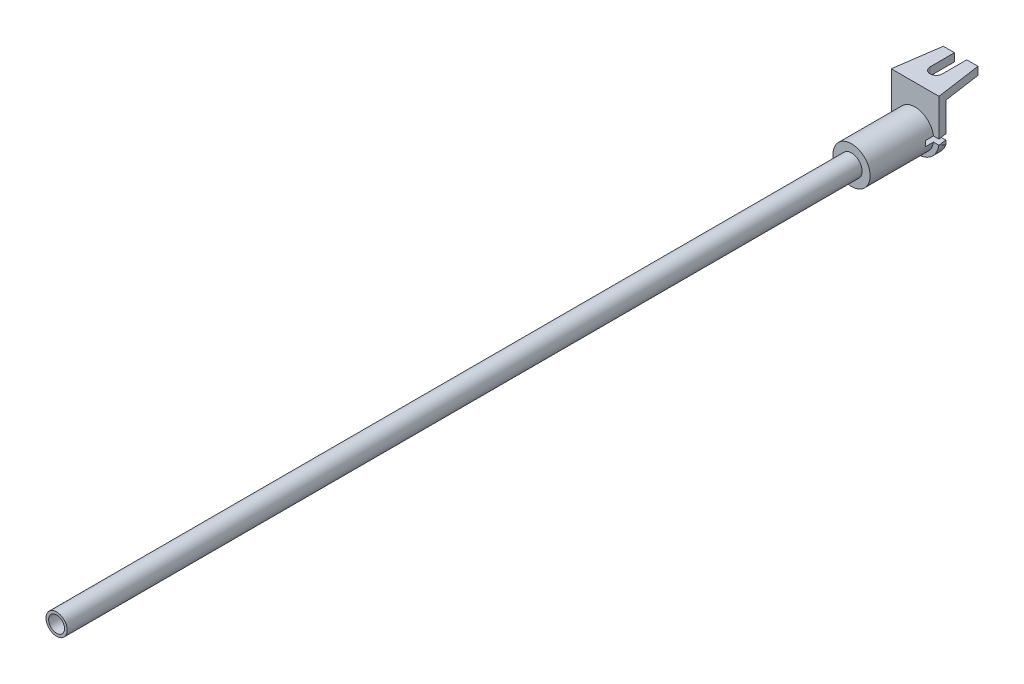
ISO-10303-21;
HEADER;
FILE_DESCRIPTION(('STEP AP214'),'2;1');
FILE_NAME('part.step','',(''),(''),'','','');
FILE_SCHEMA(('AUTOMOTIVE_DESIGN { 1 0 10303 214 1 1 1 1 }'));
ENDSEC;
DATA;
#1=APPLICATION_CONTEXT('core data for automotive mechanical design processes');
#2=APPLICATION_PROTOCOL_DEFINITION('international standard','automotive_design',2000,#1);
#3=PRODUCT_CONTEXT('',#1,'mechanical');
#4=PRODUCT('Part','Part','',(#3));
#5=PRODUCT_RELATED_PRODUCT_CATEGORY('part','',(#4));
#6=PRODUCT_DEFINITION_FORMATION('','',#4);
#7=PRODUCT_DEFINITION_CONTEXT('part definition',#1,'design');
#8=PRODUCT_DEFINITION('design','',#6,#7);
#9=PRODUCT_DEFINITION_SHAPE('','',#8);
#10=(LENGTH_UNIT() NAMED_UNIT(*) SI_UNIT(.MILLI.,.METRE.));
#11=(NAMED_UNIT(*) PLANE_ANGLE_UNIT() SI_UNIT($,.RADIAN.));
#12=(NAMED_UNIT(*) SI_UNIT($,.STERADIAN.) SOLID_ANGLE_UNIT());
#13=UNCERTAINTY_MEASURE_WITH_UNIT(LENGTH_MEASURE(1.E-05),#10,'distance_accuracy_value','');
#14=(GEOMETRIC_REPRESENTATION_CONTEXT(3) GLOBAL_UNCERTAINTY_ASSIGNED_CONTEXT((#13)) GLOBAL_UNIT_ASSIGNED_CONTEXT((#10,
#11,#12)) REPRESENTATION_CONTEXT('',''));
#15=CARTESIAN_POINT('',(0.,0.,0.));
#16=DIRECTION('',(0.,0.,1.));
#17=DIRECTION('',(1.,0.,0.));
#18=AXIS2_PLACEMENT_3D('',#15,#16,#17);
#19=CARTESIAN_POINT('',(0.,0.,12.));
#20=DIRECTION('',(0.,0.,1.));
#21=DIRECTION('',(1.,0.,0.));
#22=AXIS2_PLACEMENT_3D('',#19,#20,#21);
#23=PLANE('',#22);
#24=CARTESIAN_POINT('',(0.,0.,12.));
#25=DIRECTION('',(0.,0.,1.));
#26=DIRECTION('',(1.,0.,0.));
#27=AXIS2_PLACEMENT_3D('',#24,#25,#26);
#28=CIRCLE('',#27,3.5);
#29=CARTESIAN_POINT('',(3.5,0.,12.));
#30=VERTEX_POINT('',#29);
#31=EDGE_CURVE('E323',#30,#30,#28,.T.);
#32=ORIENTED_EDGE('',*,*,#31,.T.);
#33=EDGE_LOOP('',(#32));
#34=FACE_BOUND('',#33,.T.);
#35=CARTESIAN_POINT('',(0.,0.,12.));
#36=DIRECTION('',(0.,0.,1.));
#37=DIRECTION('',(1.,0.,0.));
#38=AXIS2_PLACEMENT_3D('',#35,#36,#37);
#39=CIRCLE('',#38,2.);
#40=CARTESIAN_POINT('',(2.,0.,12.));
#41=VERTEX_POINT('',#40);
#42=EDGE_CURVE('E311',#41,#41,#39,.T.);
#43=ORIENTED_EDGE('',*,*,#42,.F.);
#44=EDGE_LOOP('',(#43));
#45=FACE_BOUND('',#44,.T.);
#46=ADVANCED_FACE('F31',(#34,#45),#23,.T.);
#47=CARTESIAN_POINT('',(0.,0.,12.));
#48=DIRECTION('',(0.,0.,1.));
#49=DIRECTION('',(1.,0.,0.));
#50=AXIS2_PLACEMENT_3D('',#47,#48,#49);
#51=CIRCLE('',#50,1.5);
#52=CARTESIAN_POINT('',(1.5,0.,12.));
#53=VERTEX_POINT('',#52);
#54=EDGE_CURVE('E326',#53,#53,#51,.F.);
#55=ORIENTED_EDGE('',*,*,#54,.F.);
#56=EDGE_LOOP('',(#55));
#57=FACE_BOUND('',#56,.T.);
#58=CARTESIAN_POINT('',(0.,0.,12.));
#59=DIRECTION('',(0.,0.,1.));
#60=DIRECTION('',(1.,0.,0.));
#61=AXIS2_PLACEMENT_3D('',#58,#59,#60);
#62=CIRCLE('',#61,1.);
#63=CARTESIAN_POINT('',(1.,0.,12.));
#64=VERTEX_POINT('',#63);
#65=EDGE_CURVE('E320',#64,#64,#62,.T.);
#66=ORIENTED_EDGE('',*,*,#65,.F.);
#67=EDGE_LOOP('',(#66));
#68=FACE_BOUND('',#67,.T.);
#69=ADVANCED_FACE('F402',(#57,#68),#23,.T.);
#70=CARTESIAN_POINT('',(0.,0.,12.));
#71=DIRECTION('',(0.,0.,-1.));
#72=DIRECTION('',(-1.,0.,0.));
#73=AXIS2_PLACEMENT_3D('',#70,#71,#72);
#74=CYLINDRICAL_SURFACE('',#73,3.5);
#75=CARTESIAN_POINT('',(0.,0.,0.));
#76=DIRECTION('',(0.,0.,-1.));
#77=DIRECTION('',(-1.,0.,0.));
#78=AXIS2_PLACEMENT_3D('',#75,#76,#77);
#79=CIRCLE('',#78,3.5);
#80=CARTESIAN_POINT('',(3.46410161513775,-0.5,0.));
#81=VERTEX_POINT('',#80);
#82=CARTESIAN_POINT('',(3.46410161513775,0.5,0.));
#83=VERTEX_POINT('',#82);
#84=EDGE_CURVE('E305',#81,#83,#79,.T.);
#85=ORIENTED_EDGE('',*,*,#84,.F.);
#86=DIRECTION('',(0.,0.,-1.));
#87=VECTOR('',#86,1.);
#88=CARTESIAN_POINT('',(3.46410161513775,-0.500000000000002,12.));
#89=LINE('',#88,#87);
#90=CARTESIAN_POINT('',(3.46410161513775,-0.500000000000001,1.5));
#91=VERTEX_POINT('',#90);
#92=EDGE_CURVE('E265',#81,#91,#89,.F.);
#93=ORIENTED_EDGE('',*,*,#92,.T.);
#94=CARTESIAN_POINT('',(0.,0.,1.5));
#95=DIRECTION('',(0.,0.,1.));
#96=DIRECTION('',(1.,0.,0.));
#97=AXIS2_PLACEMENT_3D('',#94,#95,#96);
#98=CIRCLE('',#97,3.5);
#99=CARTESIAN_POINT('',(3.46410161513775,0.499999999999999,1.5));
#100=VERTEX_POINT('',#99);
#101=EDGE_CURVE('E285',#91,#100,#98,.T.);
#102=ORIENTED_EDGE('',*,*,#101,.T.);
#103=DIRECTION('',(0.,0.,-1.));
#104=VECTOR('',#103,1.);
#105=CARTESIAN_POINT('',(3.46410161513775,0.499999999999998,12.));
#106=LINE('',#105,#104);
#107=EDGE_CURVE('E276',#100,#83,#106,.T.);
#108=ORIENTED_EDGE('',*,*,#107,.T.);
#109=EDGE_LOOP('',(#85,#93,#102,#108));
#110=FACE_BOUND('',#109,.T.);
#111=ORIENTED_EDGE('',*,*,#31,.F.);
#112=EDGE_LOOP('',(#111));
#113=FACE_BOUND('',#112,.T.);
#114=ADVANCED_FACE('F33',(#110,#113),#74,.T.);
#115=CARTESIAN_POINT('',(0.,0.,12.));
#116=DIRECTION('',(0.,0.,-1.));
#117=DIRECTION('',(-1.,0.,0.));
#118=AXIS2_PLACEMENT_3D('',#115,#116,#117);
#119=CYLINDRICAL_SURFACE('',#118,1.);
#120=DIRECTION('',(0.,0.,-1.));
#121=VECTOR('',#120,1.);
#122=CARTESIAN_POINT('',(0.866025403784437,-0.500000000000002,12.));
#123=LINE('',#122,#121);
#124=CARTESIAN_POINT('',(0.866025403784439,-0.5,0.));
#125=VERTEX_POINT('',#124);
#126=CARTESIAN_POINT('',(0.866025403784438,-0.5,1.5));
#127=VERTEX_POINT('',#126);
#128=EDGE_CURVE('E271',#125,#127,#123,.F.);
#129=ORIENTED_EDGE('',*,*,#128,.F.);
#130=CARTESIAN_POINT('',(0.,0.,0.));
#131=DIRECTION('',(0.,0.,1.));
#132=DIRECTION('',(1.,0.,0.));
#133=AXIS2_PLACEMENT_3D('',#130,#131,#132);
#134=CIRCLE('',#133,1.);
#135=CARTESIAN_POINT('',(0.866025403784439,0.5,0.));
#136=VERTEX_POINT('',#135);
#137=EDGE_CURVE('E317',#136,#125,#134,.T.);
#138=ORIENTED_EDGE('',*,*,#137,.F.);
#139=DIRECTION('',(0.,0.,-1.));
#140=VECTOR('',#139,1.);
#141=CARTESIAN_POINT('',(0.86602540378444,0.499999999999998,12.));
#142=LINE('',#141,#140);
#143=CARTESIAN_POINT('',(0.866025403784439,0.5,1.5));
#144=VERTEX_POINT('',#143);
#145=EDGE_CURVE('E54',#144,#136,#142,.T.);
#146=ORIENTED_EDGE('',*,*,#145,.F.);
#147=CARTESIAN_POINT('',(0.,0.,1.5));
#148=DIRECTION('',(0.,0.,1.));
#149=DIRECTION('',(1.,0.,0.));
#150=AXIS2_PLACEMENT_3D('',#147,#148,#149);
#151=CIRCLE('',#150,1.);
#152=EDGE_CURVE('E347',#127,#144,#151,.T.);
#153=ORIENTED_EDGE('',*,*,#152,.F.);
#154=EDGE_LOOP('',(#129,#138,#146,#153));
#155=FACE_BOUND('',#154,.T.);
#156=ORIENTED_EDGE('',*,*,#65,.T.);
#157=EDGE_LOOP('',(#156));
#158=FACE_BOUND('',#157,.T.);
#159=ADVANCED_FACE('F368',(#155,#158),#119,.F.);
#160=CARTESIAN_POINT('',(0.,0.,162.));
#161=DIRECTION('',(0.,0.,1.));
#162=DIRECTION('',(1.,0.,0.));
#163=AXIS2_PLACEMENT_3D('',#160,#161,#162);
#164=PLANE('',#163);
#165=CARTESIAN_POINT('',(0.,0.,162.));
#166=DIRECTION('',(0.,0.,1.));
#167=DIRECTION('',(1.,0.,0.));
#168=AXIS2_PLACEMENT_3D('',#165,#166,#167);
#169=CIRCLE('',#168,2.);
#170=CARTESIAN_POINT('',(2.,0.,162.));
#171=VERTEX_POINT('',#170);
#172=EDGE_CURVE('E314',#171,#171,#169,.T.);
#173=ORIENTED_EDGE('',*,*,#172,.T.);
#174=EDGE_LOOP('',(#173));
#175=FACE_BOUND('',#174,.T.);
#176=CARTESIAN_POINT('',(0.,0.,162.));
#177=DIRECTION('',(0.,0.,1.));
#178=DIRECTION('',(1.,0.,0.));
#179=AXIS2_PLACEMENT_3D('',#176,#177,#178);
#180=CIRCLE('',#179,1.5);
#181=CARTESIAN_POINT('',(1.5,0.,162.));
#182=VERTEX_POINT('',#181);
#183=EDGE_CURVE('E308',#182,#182,#180,.T.);
#184=ORIENTED_EDGE('',*,*,#183,.F.);
#185=EDGE_LOOP('',(#184));
#186=FACE_BOUND('',#185,.T.);
#187=ADVANCED_FACE('F412',(#175,#186),#164,.T.);
#188=CARTESIAN_POINT('',(0.,0.,162.));
#189=DIRECTION('',(0.,0.,-1.));
#190=DIRECTION('',(-1.,0.,0.));
#191=AXIS2_PLACEMENT_3D('',#188,#189,#190);
#192=CYLINDRICAL_SURFACE('',#191,2.);
#193=ORIENTED_EDGE('',*,*,#172,.F.);
#194=EDGE_LOOP('',(#193));
#195=FACE_BOUND('',#194,.T.);
#196=ORIENTED_EDGE('',*,*,#42,.T.);
#197=EDGE_LOOP('',(#196));
#198=FACE_BOUND('',#197,.T.);
#199=ADVANCED_FACE('F413',(#195,#198),#192,.T.);
#200=CARTESIAN_POINT('',(0.,0.,162.));
#201=DIRECTION('',(0.,0.,-1.));
#202=DIRECTION('',(-1.,0.,0.));
#203=AXIS2_PLACEMENT_3D('',#200,#201,#202);
#204=CYLINDRICAL_SURFACE('',#203,1.5);
#205=ORIENTED_EDGE('',*,*,#183,.T.);
#206=EDGE_LOOP('',(#205));
#207=FACE_BOUND('',#206,.T.);
#208=ORIENTED_EDGE('',*,*,#54,.T.);
#209=EDGE_LOOP('',(#208));
#210=FACE_BOUND('',#209,.T.);
#211=ADVANCED_FACE('F416',(#207,#210),#204,.F.);
#212=CARTESIAN_POINT('',(4.5,0.,0.));
#213=DIRECTION('',(0.,0.,-1.));
#214=DIRECTION('',(-1.,0.,0.));
#215=AXIS2_PLACEMENT_3D('',#212,#213,#214);
#216=PLANE('',#215);
#217=ORIENTED_EDGE('',*,*,#137,.T.);
#218=DIRECTION('',(-1.,0.,0.));
#219=VECTOR('',#218,1.);
#220=CARTESIAN_POINT('',(4.5,-0.500000000000001,0.));
#221=LINE('',#220,#219);
#222=CARTESIAN_POINT('',(0.,-0.5,0.));
#223=VERTEX_POINT('',#222);
#224=EDGE_CURVE('E268',#125,#223,#221,.T.);
#225=ORIENTED_EDGE('',*,*,#224,.T.);
#226=DIRECTION('',(0.,1.,0.));
#227=VECTOR('',#226,1.);
#228=CARTESIAN_POINT('',(0.,0.,0.));
#229=LINE('',#228,#227);
#230=CARTESIAN_POINT('',(0.,0.5,0.));
#231=VERTEX_POINT('',#230);
#232=EDGE_CURVE('E282',#223,#231,#229,.T.);
#233=ORIENTED_EDGE('',*,*,#232,.T.);
#234=DIRECTION('',(1.,0.,0.));
#235=VECTOR('',#234,1.);
#236=CARTESIAN_POINT('',(4.5,0.499999999999999,0.));
#237=LINE('',#236,#235);
#238=EDGE_CURVE('E279',#231,#136,#237,.T.);
#239=ORIENTED_EDGE('',*,*,#238,.T.);
#240=EDGE_LOOP('',(#217,#225,#233,#239));
#241=FACE_BOUND('',#240,.T.);
#242=ADVANCED_FACE('F365',(#241),#216,.F.);
#243=CARTESIAN_POINT('',(0.5,0.,0.));
#244=DIRECTION('',(0.,0.,-1.));
#245=DIRECTION('',(-1.,0.,0.));
#246=AXIS2_PLACEMENT_3D('',#243,#244,#245);
#247=CIRCLE('',#246,4.);
#248=CARTESIAN_POINT('',(0.5,-4.,0.));
#249=VERTEX_POINT('',#248);
#250=CARTESIAN_POINT('',(4.46862696659689,-0.500000000000001,0.));
#251=VERTEX_POINT('',#250);
#252=EDGE_CURVE('E339',#249,#251,#247,.F.);
#253=ORIENTED_EDGE('',*,*,#252,.T.);
#254=DIRECTION('',(-1.,0.,0.));
#255=VECTOR('',#254,1.);
#256=CARTESIAN_POINT('',(4.5,-0.500000000000001,0.));
#257=LINE('',#256,#255);
#258=EDGE_CURVE('E261',#251,#81,#257,.T.);
#259=ORIENTED_EDGE('',*,*,#258,.T.);
#260=ORIENTED_EDGE('',*,*,#84,.T.);
#261=DIRECTION('',(1.,0.,0.));
#262=VECTOR('',#261,1.);
#263=CARTESIAN_POINT('',(4.5,0.499999999999999,0.));
#264=LINE('',#263,#262);
#265=CARTESIAN_POINT('',(4.5,0.499999999999999,0.));
#266=VERTEX_POINT('',#265);
#267=EDGE_CURVE('E273',#83,#266,#264,.T.);
#268=ORIENTED_EDGE('',*,*,#267,.T.);
#269=DIRECTION('',(0.,-1.,0.));
#270=VECTOR('',#269,1.);
#271=CARTESIAN_POINT('',(4.5,-4.,0.));
#272=LINE('',#271,#270);
#273=CARTESIAN_POINT('',(4.5,7.5,0.));
#274=VERTEX_POINT('',#273);
#275=EDGE_CURVE('E291',#274,#266,#272,.T.);
#276=ORIENTED_EDGE('',*,*,#275,.F.);
#277=DIRECTION('',(-1.,0.,0.));
#278=VECTOR('',#277,1.);
#279=CARTESIAN_POINT('',(4.5,7.5,0.));
#280=LINE('',#279,#278);
#281=CARTESIAN_POINT('',(-4.5,7.5,0.));
#282=VERTEX_POINT('',#281);
#283=EDGE_CURVE('E293',#274,#282,#280,.T.);
#284=ORIENTED_EDGE('',*,*,#283,.T.);
#285=DIRECTION('',(0.,-1.,0.));
#286=VECTOR('',#285,1.);
#287=CARTESIAN_POINT('',(-4.5,0.,0.));
#288=LINE('',#287,#286);
#289=CARTESIAN_POINT('',(-4.5,0.,0.));
#290=VERTEX_POINT('',#289);
#291=EDGE_CURVE('E288',#282,#290,#288,.T.);
#292=ORIENTED_EDGE('',*,*,#291,.T.);
#293=CARTESIAN_POINT('',(-0.5,0.,0.));
#294=DIRECTION('',(0.,0.,-1.));
#295=DIRECTION('',(-1.,0.,0.));
#296=AXIS2_PLACEMENT_3D('',#293,#294,#295);
#297=CIRCLE('',#296,4.);
#298=CARTESIAN_POINT('',(-0.5,-4.,0.));
#299=VERTEX_POINT('',#298);
#300=EDGE_CURVE('E342',#290,#299,#297,.F.);
#301=ORIENTED_EDGE('',*,*,#300,.T.);
#302=DIRECTION('',(-1.,0.,0.));
#303=VECTOR('',#302,1.);
#304=CARTESIAN_POINT('',(4.5,-4.,0.));
#305=LINE('',#304,#303);
#306=EDGE_CURVE('E302',#249,#299,#305,.T.);
#307=ORIENTED_EDGE('',*,*,#306,.F.);
#308=EDGE_LOOP('',(#253,#259,#260,#268,#276,#284,#292,#301,#307));
#309=FACE_BOUND('',#308,.T.);
#310=ADVANCED_FACE('F378',(#309),#216,.F.);
#311=CARTESIAN_POINT('',(4.5,-4.,-1.5));
#312=DIRECTION('',(0.,1.,0.));
#313=DIRECTION('',(0.,0.,1.));
#314=AXIS2_PLACEMENT_3D('',#311,#312,#313);
#315=PLANE('',#314);
#316=ORIENTED_EDGE('',*,*,#306,.T.);
#317=DIRECTION('',(0.,0.,-1.));
#318=VECTOR('',#317,1.);
#319=CARTESIAN_POINT('',(-0.5,-4.,-1.5));
#320=LINE('',#319,#318);
#321=CARTESIAN_POINT('',(-0.5,-4.,-1.5));
#322=VERTEX_POINT('',#321);
#323=EDGE_CURVE('E331',#299,#322,#320,.T.);
#324=ORIENTED_EDGE('',*,*,#323,.T.);
#325=DIRECTION('',(-1.,0.,0.));
#326=VECTOR('',#325,1.);
#327=CARTESIAN_POINT('',(4.5,-4.,-1.5));
#328=LINE('',#327,#326);
#329=CARTESIAN_POINT('',(0.5,-4.,-1.5));
#330=VERTEX_POINT('',#329);
#331=EDGE_CURVE('E299',#330,#322,#328,.T.);
#332=ORIENTED_EDGE('',*,*,#331,.F.);
#333=DIRECTION('',(0.,0.,-1.));
#334=VECTOR('',#333,1.);
#335=CARTESIAN_POINT('',(0.5,-4.,-1.5));
#336=LINE('',#335,#334);
#337=EDGE_CURVE('E329',#330,#249,#336,.F.);
#338=ORIENTED_EDGE('',*,*,#337,.T.);
#339=EDGE_LOOP('',(#316,#324,#332,#338));
#340=FACE_BOUND('',#339,.T.);
#341=ADVANCED_FACE('F424',(#340),#315,.F.);
#342=CARTESIAN_POINT('',(4.5,6.,-1.5));
#343=DIRECTION('',(0.,0.,1.));
#344=DIRECTION('',(0.,-1.,0.));
#345=AXIS2_PLACEMENT_3D('',#342,#343,#344);
#346=PLANE('',#345);
#347=CARTESIAN_POINT('',(-0.5,0.,-1.5));
#348=DIRECTION('',(0.,0.,1.));
#349=DIRECTION('',(0.,-1.,0.));
#350=AXIS2_PLACEMENT_3D('',#347,#348,#349);
#351=CIRCLE('',#350,4.);
#352=CARTESIAN_POINT('',(-4.28577574782189,-1.29147279770176,-1.5));
#353=VERTEX_POINT('',#352);
#354=EDGE_CURVE('E336',#322,#353,#351,.F.);
#355=ORIENTED_EDGE('',*,*,#354,.T.);
#356=DIRECTION('',(0.,1.,0.));
#357=VECTOR('',#356,1.);
#358=CARTESIAN_POINT('',(-4.28577574782189,6.,-1.5));
#359=LINE('',#358,#357);
#360=CARTESIAN_POINT('',(-4.28577574782189,6.,-1.5));
#361=VERTEX_POINT('',#360);
#362=EDGE_CURVE('E225',#353,#361,#359,.T.);
#363=ORIENTED_EDGE('',*,*,#362,.T.);
#364=DIRECTION('',(-1.,0.,0.));
#365=VECTOR('',#364,1.);
#366=CARTESIAN_POINT('',(4.5,6.,-1.5));
#367=LINE('',#366,#365);
#368=CARTESIAN_POINT('',(4.28577574782189,6.,-1.5));
#369=VERTEX_POINT('',#368);
#370=EDGE_CURVE('E296',#369,#361,#367,.T.);
#371=ORIENTED_EDGE('',*,*,#370,.F.);
#372=DIRECTION('',(0.,-1.,0.));
#373=VECTOR('',#372,1.);
#374=CARTESIAN_POINT('',(4.28577574782189,6.,-1.5));
#375=LINE('',#374,#373);
#376=CARTESIAN_POINT('',(4.28577574782189,0.5,-1.5));
#377=VERTEX_POINT('',#376);
#378=EDGE_CURVE('E219',#369,#377,#375,.T.);
#379=ORIENTED_EDGE('',*,*,#378,.T.);
#380=DIRECTION('',(1.,0.,0.));
#381=VECTOR('',#380,1.);
#382=CARTESIAN_POINT('',(0.,0.5,-1.5));
#383=LINE('',#382,#381);
#384=CARTESIAN_POINT('',(0.,0.5,-1.5));
#385=VERTEX_POINT('',#384);
#386=EDGE_CURVE('E246',#385,#377,#383,.T.);
#387=ORIENTED_EDGE('',*,*,#386,.F.);
#388=DIRECTION('',(0.,1.,0.));
#389=VECTOR('',#388,1.);
#390=CARTESIAN_POINT('',(0.,0.5,-1.5));
#391=LINE('',#390,#389);
#392=CARTESIAN_POINT('',(0.,-0.5,-1.5));
#393=VERTEX_POINT('',#392);
#394=EDGE_CURVE('E243',#393,#385,#391,.T.);
#395=ORIENTED_EDGE('',*,*,#394,.F.);
#396=DIRECTION('',(-1.,0.,0.));
#397=VECTOR('',#396,1.);
#398=CARTESIAN_POINT('',(0.,-0.5,-1.5));
#399=LINE('',#398,#397);
#400=CARTESIAN_POINT('',(4.28577574782189,-0.5,-1.5));
#401=VERTEX_POINT('',#400);
#402=EDGE_CURVE('E249',#401,#393,#399,.T.);
#403=ORIENTED_EDGE('',*,*,#402,.F.);
#404=CARTESIAN_POINT('',(4.28577574782189,-1.29147279770176,-1.5));
#405=VERTEX_POINT('',#404);
#406=EDGE_CURVE('E46',#401,#405,#375,.T.);
#407=ORIENTED_EDGE('',*,*,#406,.T.);
#408=CARTESIAN_POINT('',(0.5,0.,-1.5));
#409=DIRECTION('',(0.,0.,1.));
#410=DIRECTION('',(0.,-1.,0.));
#411=AXIS2_PLACEMENT_3D('',#408,#409,#410);
#412=CIRCLE('',#411,4.);
#413=EDGE_CURVE('E334',#405,#330,#412,.F.);
#414=ORIENTED_EDGE('',*,*,#413,.T.);
#415=ORIENTED_EDGE('',*,*,#331,.T.);
#416=EDGE_LOOP('',(#355,#363,#371,#379,#387,#395,#403,#407,#414,#415));
#417=FACE_BOUND('',#416,.T.);
#418=ADVANCED_FACE('F356',(#417),#346,.F.);
#419=CARTESIAN_POINT('',(4.5,6.,-11.5));
#420=DIRECTION('',(0.,1.,0.));
#421=DIRECTION('',(0.,0.,1.));
#422=AXIS2_PLACEMENT_3D('',#419,#420,#421);
#423=PLANE('',#422);
#424=ORIENTED_EDGE('',*,*,#370,.T.);
#425=DIRECTION('',(0.141381604232184,0.,-0.989955171704625));
#426=VECTOR('',#425,1.);
#427=CARTESIAN_POINT('',(-2.71054449948681,6.,-12.5297823354664));
#428=LINE('',#427,#426);
#429=CARTESIAN_POINT('',(-3.27253479916799,6.,-8.59472157110019));
#430=VERTEX_POINT('',#429);
#431=EDGE_CURVE('E228',#361,#430,#428,.T.);
#432=ORIENTED_EDGE('',*,*,#431,.T.);
#433=DIRECTION('',(1.,0.,0.));
#434=VECTOR('',#433,1.);
#435=CARTESIAN_POINT('',(4.5,6.,-8.59472157110019));
#436=LINE('',#435,#434);
#437=CARTESIAN_POINT('',(-1.15584294548487,6.,-8.59472157110019));
#438=VERTEX_POINT('',#437);
#439=EDGE_CURVE('E241',#430,#438,#436,.T.);
#440=ORIENTED_EDGE('',*,*,#439,.T.);
#441=DIRECTION('',(0.,0.,1.));
#442=VECTOR('',#441,1.);
#443=CARTESIAN_POINT('',(-1.15584294548487,6.,-11.5));
#444=LINE('',#443,#442);
#445=CARTESIAN_POINT('',(-1.15584294548487,6.,-3.98824612955578));
#446=VERTEX_POINT('',#445);
#447=EDGE_CURVE('E176',#438,#446,#444,.T.);
#448=ORIENTED_EDGE('',*,*,#447,.T.);
#449=CARTESIAN_POINT('',(0.,6.,-3.98824612955575));
#450=DIRECTION('',(0.,1.,0.));
#451=DIRECTION('',(0.,0.,1.));
#452=AXIS2_PLACEMENT_3D('',#449,#450,#451);
#453=CIRCLE('',#452,1.15584294548487);
#454=CARTESIAN_POINT('',(1.15584294548487,6.,-3.98824612955578));
#455=VERTEX_POINT('',#454);
#456=EDGE_CURVE('E232',#446,#455,#453,.T.);
#457=ORIENTED_EDGE('',*,*,#456,.T.);
#458=DIRECTION('',(0.,0.,-1.));
#459=VECTOR('',#458,1.);
#460=CARTESIAN_POINT('',(1.15584294548487,6.,-11.5));
#461=LINE('',#460,#459);
#462=CARTESIAN_POINT('',(1.15584294548487,6.,-8.59472157110019));
#463=VERTEX_POINT('',#462);
#464=EDGE_CURVE('E235',#455,#463,#461,.T.);
#465=ORIENTED_EDGE('',*,*,#464,.T.);
#466=DIRECTION('',(1.,0.,0.));
#467=VECTOR('',#466,1.);
#468=CARTESIAN_POINT('',(4.5,6.,-8.59472157110019));
#469=LINE('',#468,#467);
#470=CARTESIAN_POINT('',(3.27253479916799,6.,-8.59472157110019));
#471=VERTEX_POINT('',#470);
#472=EDGE_CURVE('E238',#463,#471,#469,.T.);
#473=ORIENTED_EDGE('',*,*,#472,.T.);
#474=DIRECTION('',(0.141381604232184,0.,0.989955171704625));
#475=VECTOR('',#474,1.);
#476=CARTESIAN_POINT('',(2.8904433216242,6.,-11.2701292828244));
#477=LINE('',#476,#475);
#478=EDGE_CURVE('E222',#471,#369,#477,.T.);
#479=ORIENTED_EDGE('',*,*,#478,.T.);
#480=EDGE_LOOP('',(#424,#432,#440,#448,#457,#465,#473,#479));
#481=FACE_BOUND('',#480,.T.);
#482=ADVANCED_FACE('F430',(#481),#423,.F.);
#483=CARTESIAN_POINT('',(4.5,7.5,0.));
#484=DIRECTION('',(0.,-1.,0.));
#485=DIRECTION('',(0.,0.,-1.));
#486=AXIS2_PLACEMENT_3D('',#483,#484,#485);
#487=PLANE('',#486);
#488=DIRECTION('',(1.,0.,0.));
#489=VECTOR('',#488,1.);
#490=CARTESIAN_POINT('',(-1.15584294548487,7.5,-8.59472157110019));
#491=LINE('',#490,#489);
#492=CARTESIAN_POINT('',(-3.27253479916799,7.5,-8.59472157110019));
#493=VERTEX_POINT('',#492);
#494=CARTESIAN_POINT('',(-1.15584294548487,7.5,-8.59472157110019));
#495=VERTEX_POINT('',#494);
#496=EDGE_CURVE('E183',#493,#495,#491,.T.);
#497=ORIENTED_EDGE('',*,*,#496,.F.);
#498=DIRECTION('',(0.141381604232184,0.,-0.989955171704625));
#499=VECTOR('',#498,1.);
#500=CARTESIAN_POINT('',(-3.27253479916799,7.5,-8.59472157110019));
#501=LINE('',#500,#499);
#502=EDGE_CURVE('E180',#282,#493,#501,.T.);
#503=ORIENTED_EDGE('',*,*,#502,.F.);
#504=ORIENTED_EDGE('',*,*,#283,.F.);
#505=DIRECTION('',(0.141381604232184,0.,0.989955171704625));
#506=VECTOR('',#505,1.);
#507=CARTESIAN_POINT('',(3.27253479916799,7.5,-8.59472157110019));
#508=LINE('',#507,#506);
#509=CARTESIAN_POINT('',(3.27253479916799,7.5,-8.59472157110019));
#510=VERTEX_POINT('',#509);
#511=EDGE_CURVE('E204',#510,#274,#508,.T.);
#512=ORIENTED_EDGE('',*,*,#511,.F.);
#513=DIRECTION('',(1.,0.,0.));
#514=VECTOR('',#513,1.);
#515=CARTESIAN_POINT('',(3.27253479916799,7.5,-8.59472157110019));
#516=LINE('',#515,#514);
#517=CARTESIAN_POINT('',(1.15584294548487,7.5,-8.59472157110019));
#518=VERTEX_POINT('',#517);
#519=EDGE_CURVE('E201',#518,#510,#516,.T.);
#520=ORIENTED_EDGE('',*,*,#519,.F.);
#521=DIRECTION('',(0.,0.,-1.));
#522=VECTOR('',#521,1.);
#523=CARTESIAN_POINT('',(1.15584294548487,7.5,-8.59472157110019));
#524=LINE('',#523,#522);
#525=CARTESIAN_POINT('',(1.15584294548487,7.5,-3.98824612955578));
#526=VERTEX_POINT('',#525);
#527=EDGE_CURVE('E196',#526,#518,#524,.T.);
#528=ORIENTED_EDGE('',*,*,#527,.F.);
#529=CARTESIAN_POINT('',(0.,7.5,-3.98824612955575));
#530=DIRECTION('',(0.,1.,0.));
#531=DIRECTION('',(0.,0.,1.));
#532=AXIS2_PLACEMENT_3D('',#529,#530,#531);
#533=CIRCLE('',#532,1.15584294548487);
#534=CARTESIAN_POINT('',(-1.15584294548487,7.5,-3.98824612955578));
#535=VERTEX_POINT('',#534);
#536=EDGE_CURVE('E194',#535,#526,#533,.T.);
#537=ORIENTED_EDGE('',*,*,#536,.F.);
#538=DIRECTION('',(0.,0.,1.));
#539=VECTOR('',#538,1.);
#540=CARTESIAN_POINT('',(-1.15584294548487,7.5,-8.59472157110019));
#541=LINE('',#540,#539);
#542=EDGE_CURVE('E173',#495,#535,#541,.T.);
#543=ORIENTED_EDGE('',*,*,#542,.F.);
#544=EDGE_LOOP('',(#497,#503,#504,#512,#520,#528,#537,#543));
#545=FACE_BOUND('',#544,.T.);
#546=ADVANCED_FACE('F191',(#545),#487,.F.);
#547=CARTESIAN_POINT('',(-0.5,0.,-1.5));
#548=DIRECTION('',(0.,0.,1.));
#549=DIRECTION('',(1.,0.,0.));
#550=AXIS2_PLACEMENT_3D('',#547,#548,#549);
#551=CYLINDRICAL_SURFACE('',#550,4.);
#552=CARTESIAN_POINT('',(-0.5,0.,-28.0080333528786));
#553=DIRECTION('',(0.989955171704625,0.,0.141381604232184));
#554=DIRECTION('',(-0.141381604232184,0.,0.989955171704625));
#555=AXIS2_PLACEMENT_3D('',#552,#553,#554);
#556=ELLIPSE('',#555,28.2922238838865,4.);
#557=EDGE_CURVE('E11',#353,#290,#556,.F.);
#558=ORIENTED_EDGE('',*,*,#557,.F.);
#559=ORIENTED_EDGE('',*,*,#354,.F.);
#560=ORIENTED_EDGE('',*,*,#323,.F.);
#561=ORIENTED_EDGE('',*,*,#300,.F.);
#562=EDGE_LOOP('',(#558,#559,#560,#561));
#563=FACE_BOUND('',#562,.T.);
#564=ADVANCED_FACE('F436',(#563),#551,.T.);
#565=CARTESIAN_POINT('',(0.5,0.,0.));
#566=DIRECTION('',(0.,0.,-1.));
#567=DIRECTION('',(-1.,0.,0.));
#568=AXIS2_PLACEMENT_3D('',#565,#566,#567);
#569=CYLINDRICAL_SURFACE('',#568,4.);
#570=CARTESIAN_POINT('',(0.5,0.,-28.0080333528786));
#571=DIRECTION('',(-0.989955171704625,0.,0.141381604232184));
#572=DIRECTION('',(-0.141381604232184,0.,-0.989955171704625));
#573=AXIS2_PLACEMENT_3D('',#570,#571,#572);
#574=ELLIPSE('',#573,28.2922238838865,4.);
#575=CARTESIAN_POINT('',(4.46862696659689,-0.5,-0.21967424148385));
#576=VERTEX_POINT('',#575);
#577=EDGE_CURVE('E208',#576,#405,#574,.F.);
#578=ORIENTED_EDGE('',*,*,#577,.F.);
#579=DIRECTION('',(0.,0.,-1.));
#580=VECTOR('',#579,1.);
#581=CARTESIAN_POINT('',(4.46862696659689,-0.500000000000001,0.));
#582=LINE('',#581,#580);
#583=EDGE_CURVE('E344',#251,#576,#582,.T.);
#584=ORIENTED_EDGE('',*,*,#583,.F.);
#585=ORIENTED_EDGE('',*,*,#252,.F.);
#586=ORIENTED_EDGE('',*,*,#337,.F.);
#587=ORIENTED_EDGE('',*,*,#413,.F.);
#588=EDGE_LOOP('',(#578,#584,#585,#586,#587));
#589=FACE_BOUND('',#588,.T.);
#590=ADVANCED_FACE('F383',(#589),#569,.T.);
#591=CARTESIAN_POINT('',(0.,-0.5,1.5));
#592=DIRECTION('',(0.,0.,1.));
#593=DIRECTION('',(1.,0.,0.));
#594=AXIS2_PLACEMENT_3D('',#591,#592,#593);
#595=PLANE('',#594);
#596=DIRECTION('',(-1.,0.,0.));
#597=VECTOR('',#596,1.);
#598=CARTESIAN_POINT('',(0.,-0.5,1.5));
#599=LINE('',#598,#597);
#600=EDGE_CURVE('E254',#91,#127,#599,.T.);
#601=ORIENTED_EDGE('',*,*,#600,.T.);
#602=ORIENTED_EDGE('',*,*,#152,.T.);
#603=DIRECTION('',(1.,0.,0.));
#604=VECTOR('',#603,1.);
#605=CARTESIAN_POINT('',(0.,0.5,1.5));
#606=LINE('',#605,#604);
#607=EDGE_CURVE('E251',#144,#100,#606,.T.);
#608=ORIENTED_EDGE('',*,*,#607,.T.);
#609=ORIENTED_EDGE('',*,*,#101,.F.);
#610=EDGE_LOOP('',(#601,#602,#608,#609));
#611=FACE_BOUND('',#610,.T.);
#612=ADVANCED_FACE('F373',(#611),#595,.F.);
#613=CARTESIAN_POINT('',(0.,0.5,1.5));
#614=DIRECTION('',(-1.,0.,0.));
#615=DIRECTION('',(0.,-1.,0.));
#616=AXIS2_PLACEMENT_3D('',#613,#614,#615);
#617=PLANE('',#616);
#618=DIRECTION('',(0.,0.,-1.));
#619=VECTOR('',#618,1.);
#620=CARTESIAN_POINT('',(0.,-0.5,1.5));
#621=LINE('',#620,#619);
#622=EDGE_CURVE('E258',#223,#393,#621,.T.);
#623=ORIENTED_EDGE('',*,*,#622,.T.);
#624=ORIENTED_EDGE('',*,*,#394,.T.);
#625=DIRECTION('',(0.,0.,-1.));
#626=VECTOR('',#625,1.);
#627=CARTESIAN_POINT('',(0.,0.5,1.5));
#628=LINE('',#627,#626);
#629=EDGE_CURVE('E257',#231,#385,#628,.T.);
#630=ORIENTED_EDGE('',*,*,#629,.F.);
#631=ORIENTED_EDGE('',*,*,#232,.F.);
#632=EDGE_LOOP('',(#623,#624,#630,#631));
#633=FACE_BOUND('',#632,.T.);
#634=ADVANCED_FACE('F362',(#633),#617,.F.);
#635=CARTESIAN_POINT('',(0.,0.5,1.5));
#636=DIRECTION('',(0.,1.,0.));
#637=DIRECTION('',(0.,0.,1.));
#638=AXIS2_PLACEMENT_3D('',#635,#636,#637);
#639=PLANE('',#638);
#640=ORIENTED_EDGE('',*,*,#386,.T.);
#641=DIRECTION('',(0.141381604232184,0.,0.989955171704625));
#642=VECTOR('',#641,1.);
#643=CARTESIAN_POINT('',(4.61999276437162,0.499999999999999,0.840190336656138));
#644=LINE('',#643,#642);
#645=EDGE_CURVE('E218',#377,#266,#644,.T.);
#646=ORIENTED_EDGE('',*,*,#645,.T.);
#647=ORIENTED_EDGE('',*,*,#267,.F.);
#648=ORIENTED_EDGE('',*,*,#107,.F.);
#649=ORIENTED_EDGE('',*,*,#607,.F.);
#650=ORIENTED_EDGE('',*,*,#145,.T.);
#651=ORIENTED_EDGE('',*,*,#238,.F.);
#652=ORIENTED_EDGE('',*,*,#629,.T.);
#653=EDGE_LOOP('',(#640,#646,#647,#648,#649,#650,#651,#652));
#654=FACE_BOUND('',#653,.T.);
#655=ADVANCED_FACE('F394',(#654),#639,.F.);
#656=CARTESIAN_POINT('',(0.,-0.5,1.5));
#657=DIRECTION('',(0.,-1.,0.));
#658=DIRECTION('',(0.,0.,-1.));
#659=AXIS2_PLACEMENT_3D('',#656,#657,#658);
#660=PLANE('',#659);
#661=ORIENTED_EDGE('',*,*,#583,.T.);
#662=DIRECTION('',(-0.141381604232184,0.,-0.989955171704625));
#663=VECTOR('',#662,1.);
#664=CARTESIAN_POINT('',(4.61999276437162,-0.500000000000001,0.840190336656138));
#665=LINE('',#664,#663);
#666=EDGE_CURVE('E39',#576,#401,#665,.T.);
#667=ORIENTED_EDGE('',*,*,#666,.T.);
#668=ORIENTED_EDGE('',*,*,#402,.T.);
#669=ORIENTED_EDGE('',*,*,#622,.F.);
#670=ORIENTED_EDGE('',*,*,#224,.F.);
#671=ORIENTED_EDGE('',*,*,#128,.T.);
#672=ORIENTED_EDGE('',*,*,#600,.F.);
#673=ORIENTED_EDGE('',*,*,#92,.F.);
#674=ORIENTED_EDGE('',*,*,#258,.F.);
#675=EDGE_LOOP('',(#661,#667,#668,#669,#670,#671,#672,#673,#674));
#676=FACE_BOUND('',#675,.T.);
#677=ADVANCED_FACE('F350',(#676),#660,.F.);
#678=CARTESIAN_POINT('',(3.27253479916799,-4.,-8.59472157110019));
#679=DIRECTION('',(-0.989955171704625,0.,0.141381604232184));
#680=DIRECTION('',(0.141381604232184,0.,0.989955171704625));
#681=AXIS2_PLACEMENT_3D('',#678,#679,#680);
#682=PLANE('',#681);
#683=ORIENTED_EDGE('',*,*,#666,.F.);
#684=ORIENTED_EDGE('',*,*,#577,.T.);
#685=ORIENTED_EDGE('',*,*,#406,.F.);
#686=EDGE_LOOP('',(#683,#684,#685));
#687=FACE_BOUND('',#686,.T.);
#688=ADVANCED_FACE('F384',(#687),#682,.F.);
#689=CARTESIAN_POINT('',(-1.15584294548487,-4.,-8.59472157110019));
#690=DIRECTION('',(0.,0.,1.));
#691=DIRECTION('',(1.,0.,0.));
#692=AXIS2_PLACEMENT_3D('',#689,#690,#691);
#693=PLANE('',#692);
#694=DIRECTION('',(0.,1.,0.));
#695=VECTOR('',#694,1.);
#696=CARTESIAN_POINT('',(-3.27253479916799,-4.,-8.59472157110019));
#697=LINE('',#696,#695);
#698=EDGE_CURVE('E186',#430,#493,#697,.T.);
#699=ORIENTED_EDGE('',*,*,#698,.T.);
#700=ORIENTED_EDGE('',*,*,#496,.T.);
#701=DIRECTION('',(0.,1.,0.));
#702=VECTOR('',#701,1.);
#703=CARTESIAN_POINT('',(-1.15584294548487,-4.,-8.59472157110019));
#704=LINE('',#703,#702);
#705=EDGE_CURVE('E168',#438,#495,#704,.T.);
#706=ORIENTED_EDGE('',*,*,#705,.F.);
#707=ORIENTED_EDGE('',*,*,#439,.F.);
#708=EDGE_LOOP('',(#699,#700,#706,#707));
#709=FACE_BOUND('',#708,.T.);
#710=ADVANCED_FACE('F184',(#709),#693,.F.);
#711=CARTESIAN_POINT('',(3.27253479916799,-4.,-8.59472157110019));
#712=DIRECTION('',(0.,0.,1.));
#713=DIRECTION('',(1.,0.,0.));
#714=AXIS2_PLACEMENT_3D('',#711,#712,#713);
#715=PLANE('',#714);
#716=DIRECTION('',(0.,1.,0.));
#717=VECTOR('',#716,1.);
#718=CARTESIAN_POINT('',(1.15584294548487,-4.,-8.59472157110019));
#719=LINE('',#718,#717);
#720=EDGE_CURVE('E211',#463,#518,#719,.T.);
#721=ORIENTED_EDGE('',*,*,#720,.T.);
#722=ORIENTED_EDGE('',*,*,#519,.T.);
#723=DIRECTION('',(0.,1.,0.));
#724=VECTOR('',#723,1.);
#725=CARTESIAN_POINT('',(3.27253479916799,-4.,-8.59472157110019));
#726=LINE('',#725,#724);
#727=EDGE_CURVE('E209',#471,#510,#726,.T.);
#728=ORIENTED_EDGE('',*,*,#727,.F.);
#729=ORIENTED_EDGE('',*,*,#472,.F.);
#730=EDGE_LOOP('',(#721,#722,#728,#729));
#731=FACE_BOUND('',#730,.T.);
#732=ADVANCED_FACE('F392',(#731),#715,.F.);
#733=CARTESIAN_POINT('',(1.15584294548487,-4.,-8.59472157110019));
#734=DIRECTION('',(1.,0.,0.));
#735=DIRECTION('',(0.,0.,-1.));
#736=AXIS2_PLACEMENT_3D('',#733,#734,#735);
#737=PLANE('',#736);
#738=DIRECTION('',(0.,1.,0.));
#739=VECTOR('',#738,1.);
#740=CARTESIAN_POINT('',(1.15584294548487,-4.,-3.98824612955578));
#741=LINE('',#740,#739);
#742=EDGE_CURVE('E213',#455,#526,#741,.T.);
#743=ORIENTED_EDGE('',*,*,#742,.T.);
#744=ORIENTED_EDGE('',*,*,#527,.T.);
#745=ORIENTED_EDGE('',*,*,#720,.F.);
#746=ORIENTED_EDGE('',*,*,#464,.F.);
#747=EDGE_LOOP('',(#743,#744,#745,#746));
#748=FACE_BOUND('',#747,.T.);
#749=ADVANCED_FACE('F455',(#748),#737,.F.);
#750=CARTESIAN_POINT('',(0.,-4.,-3.98824612955575));
#751=DIRECTION('',(0.,1.,0.));
#752=DIRECTION('',(0.,0.,1.));
#753=AXIS2_PLACEMENT_3D('',#750,#751,#752);
#754=CYLINDRICAL_SURFACE('',#753,1.15584294548487);
#755=DIRECTION('',(0.,1.,0.));
#756=VECTOR('',#755,1.);
#757=CARTESIAN_POINT('',(-1.15584294548487,-4.,-3.98824612955578));
#758=LINE('',#757,#756);
#759=EDGE_CURVE('E179',#446,#535,#758,.T.);
#760=ORIENTED_EDGE('',*,*,#759,.T.);
#761=ORIENTED_EDGE('',*,*,#536,.T.);
#762=ORIENTED_EDGE('',*,*,#742,.F.);
#763=ORIENTED_EDGE('',*,*,#456,.F.);
#764=EDGE_LOOP('',(#760,#761,#762,#763));
#765=FACE_BOUND('',#764,.T.);
#766=ADVANCED_FACE('F452',(#765),#754,.F.);
#767=CARTESIAN_POINT('',(-1.15584294548487,-4.,-8.59472157110019));
#768=DIRECTION('',(-1.,0.,0.));
#769=DIRECTION('',(0.,0.,1.));
#770=AXIS2_PLACEMENT_3D('',#767,#768,#769);
#771=PLANE('',#770);
#772=ORIENTED_EDGE('',*,*,#705,.T.);
#773=ORIENTED_EDGE('',*,*,#542,.T.);
#774=ORIENTED_EDGE('',*,*,#759,.F.);
#775=ORIENTED_EDGE('',*,*,#447,.F.);
#776=EDGE_LOOP('',(#772,#773,#774,#775));
#777=FACE_BOUND('',#776,.T.);
#778=ADVANCED_FACE('F170',(#777),#771,.F.);
#779=CARTESIAN_POINT('',(-3.27253479916799,-4.,-8.59472157110019));
#780=DIRECTION('',(0.989955171704625,0.,0.141381604232184));
#781=DIRECTION('',(0.141381604232184,0.,-0.989955171704625));
#782=AXIS2_PLACEMENT_3D('',#779,#780,#781);
#783=PLANE('',#782);
#784=ORIENTED_EDGE('',*,*,#362,.F.);
#785=ORIENTED_EDGE('',*,*,#557,.T.);
#786=ORIENTED_EDGE('',*,*,#291,.F.);
#787=ORIENTED_EDGE('',*,*,#502,.T.);
#788=ORIENTED_EDGE('',*,*,#698,.F.);
#789=ORIENTED_EDGE('',*,*,#431,.F.);
#790=EDGE_LOOP('',(#784,#785,#786,#787,#788,#789));
#791=FACE_BOUND('',#790,.T.);
#792=ADVANCED_FACE('F399',(#791),#783,.F.);
#793=ORIENTED_EDGE('',*,*,#727,.T.);
#794=ORIENTED_EDGE('',*,*,#511,.T.);
#795=ORIENTED_EDGE('',*,*,#275,.T.);
#796=ORIENTED_EDGE('',*,*,#645,.F.);
#797=ORIENTED_EDGE('',*,*,#378,.F.);
#798=ORIENTED_EDGE('',*,*,#478,.F.);
#799=EDGE_LOOP('',(#793,#794,#795,#796,#797,#798));
#800=FACE_BOUND('',#799,.T.);
#801=ADVANCED_FACE('F387',(#800),#682,.F.);
#802=CLOSED_SHELL('',(#46,#69,#114,#159,#187,#199,#211,#242,#310,#341,#418,#482,#546,#564,#590,
#612,#634,#655,#677,#688,#710,#732,#749,#766,#778,#792,#801));
#803=MANIFOLD_SOLID_BREP('B2',#802);
#804=ADVANCED_BREP_SHAPE_REPRESENTATION('',(#18,#803),#14);
#805=SHAPE_DEFINITION_REPRESENTATION(#9,#804);
ENDSEC;
END-ISO-10303-21;
